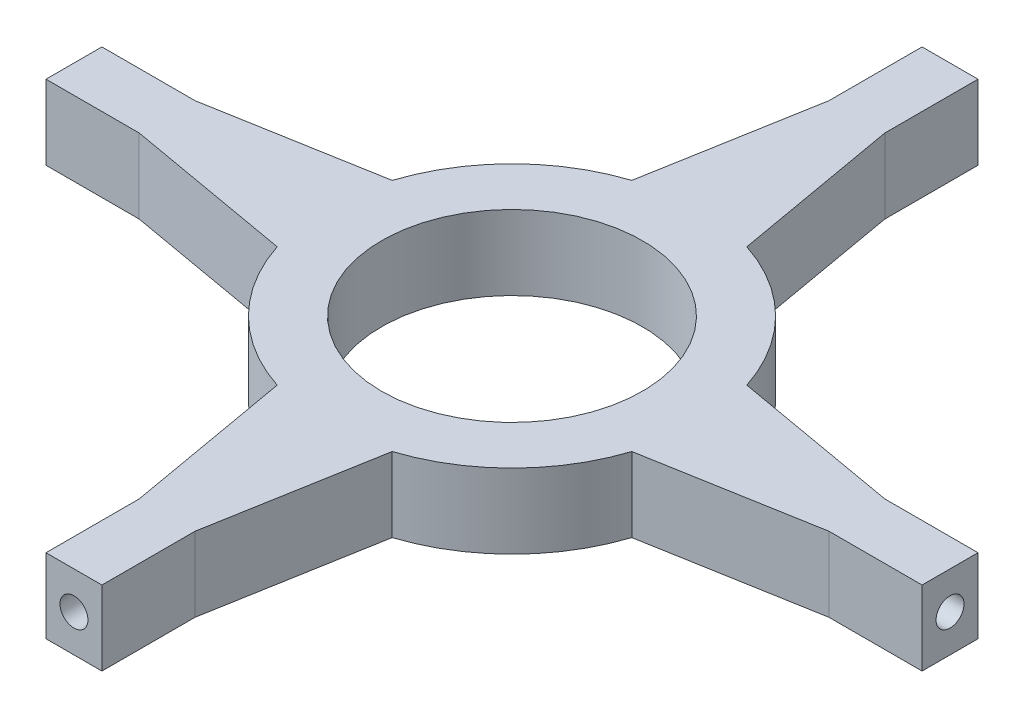
ISO-10303-21;
HEADER;
FILE_DESCRIPTION(('STEP AP214'),'2;1');
FILE_NAME('part.step','',(''),(''),'','','');
FILE_SCHEMA(('AUTOMOTIVE_DESIGN { 1 0 10303 214 1 1 1 1 }'));
ENDSEC;
DATA;
#1=APPLICATION_CONTEXT('core data for automotive mechanical design processes');
#2=APPLICATION_PROTOCOL_DEFINITION('international standard','automotive_design',2000,#1);
#3=PRODUCT_CONTEXT('',#1,'mechanical');
#4=PRODUCT('Part','Part','',(#3));
#5=PRODUCT_RELATED_PRODUCT_CATEGORY('part','',(#4));
#6=PRODUCT_DEFINITION_FORMATION('','',#4);
#7=PRODUCT_DEFINITION_CONTEXT('part definition',#1,'design');
#8=PRODUCT_DEFINITION('design','',#6,#7);
#9=PRODUCT_DEFINITION_SHAPE('','',#8);
#10=(LENGTH_UNIT() NAMED_UNIT(*) SI_UNIT(.MILLI.,.METRE.));
#11=(NAMED_UNIT(*) PLANE_ANGLE_UNIT() SI_UNIT($,.RADIAN.));
#12=(NAMED_UNIT(*) SI_UNIT($,.STERADIAN.) SOLID_ANGLE_UNIT());
#13=UNCERTAINTY_MEASURE_WITH_UNIT(LENGTH_MEASURE(1.E-05),#10,'distance_accuracy_value','');
#14=(GEOMETRIC_REPRESENTATION_CONTEXT(3) GLOBAL_UNCERTAINTY_ASSIGNED_CONTEXT((#13)) GLOBAL_UNIT_ASSIGNED_CONTEXT((#10,
#11,#12)) REPRESENTATION_CONTEXT('',''));
#15=CARTESIAN_POINT('',(0.,0.,0.));
#16=DIRECTION('',(0.,0.,1.));
#17=DIRECTION('',(1.,0.,0.));
#18=AXIS2_PLACEMENT_3D('',#15,#16,#17);
#19=CARTESIAN_POINT('',(-46.1845579135188,40.,-8.14358365224603));
#20=DIRECTION('',(-0.984807753012208,0.,-0.173648177666931));
#21=DIRECTION('',(-0.173648177666931,0.,0.984807753012208));
#22=AXIS2_PLACEMENT_3D('',#19,#20,#21);
#23=PLANE('',#22);
#24=DIRECTION('',(0.173648177666931,0.,-0.984807753012208));
#25=VECTOR('',#24,1.);
#26=CARTESIAN_POINT('',(-46.1845579135188,0.,-8.14358365224603));
#27=LINE('',#26,#25);
#28=CARTESIAN_POINT('',(-30.8477087791845,0.,-95.1231773180155));
#29=VERTEX_POINT('',#28);
#30=CARTESIAN_POINT('',(-15.,0.,-185.));
#31=VERTEX_POINT('',#30);
#32=EDGE_CURVE('E246',#29,#31,#27,.T.);
#33=ORIENTED_EDGE('',*,*,#32,.F.);
#34=DIRECTION('',(0.,-1.,0.));
#35=VECTOR('',#34,1.);
#36=CARTESIAN_POINT('',(-30.8477087791845,40.,-95.1231773180155));
#37=LINE('',#36,#35);
#38=CARTESIAN_POINT('',(-30.8477087791845,40.,-95.1231773180155));
#39=VERTEX_POINT('',#38);
#40=EDGE_CURVE('E11',#39,#29,#37,.T.);
#41=ORIENTED_EDGE('',*,*,#40,.F.);
#42=DIRECTION('',(0.173648177666931,0.,-0.984807753012208));
#43=VECTOR('',#42,1.);
#44=CARTESIAN_POINT('',(-46.1845579135188,40.,-8.14358365224603));
#45=LINE('',#44,#43);
#46=CARTESIAN_POINT('',(-15.,40.,-185.));
#47=VERTEX_POINT('',#46);
#48=EDGE_CURVE('E428',#39,#47,#45,.T.);
#49=ORIENTED_EDGE('',*,*,#48,.T.);
#50=DIRECTION('',(0.,-1.,0.));
#51=VECTOR('',#50,1.);
#52=CARTESIAN_POINT('',(-15.,40.,-185.));
#53=LINE('',#52,#51);
#54=EDGE_CURVE('E65',#47,#31,#53,.T.);
#55=ORIENTED_EDGE('',*,*,#54,.T.);
#56=EDGE_LOOP('',(#33,#41,#49,#55));
#57=FACE_BOUND('',#56,.T.);
#58=ADVANCED_FACE('F47',(#57),#23,.T.);
#59=CARTESIAN_POINT('',(0.,40.,0.));
#60=DIRECTION('',(0.,-1.,0.));
#61=DIRECTION('',(0.,0.,-1.));
#62=AXIS2_PLACEMENT_3D('',#59,#60,#61);
#63=CYLINDRICAL_SURFACE('',#62,100.);
#64=CARTESIAN_POINT('',(0.,0.,0.));
#65=DIRECTION('',(0.,1.,0.));
#66=DIRECTION('',(0.,0.,1.));
#67=AXIS2_PLACEMENT_3D('',#64,#65,#66);
#68=CIRCLE('',#67,100.);
#69=CARTESIAN_POINT('',(-95.1231773180155,0.,-30.8477087791845));
#70=VERTEX_POINT('',#69);
#71=EDGE_CURVE('E250',#29,#70,#68,.T.);
#72=ORIENTED_EDGE('',*,*,#71,.T.);
#73=DIRECTION('',(0.,-1.,0.));
#74=VECTOR('',#73,1.);
#75=CARTESIAN_POINT('',(-95.1231773180155,40.,-30.8477087791845));
#76=LINE('',#75,#74);
#77=CARTESIAN_POINT('',(-95.1231773180155,40.,-30.8477087791845));
#78=VERTEX_POINT('',#77);
#79=EDGE_CURVE('E57',#78,#70,#76,.T.);
#80=ORIENTED_EDGE('',*,*,#79,.F.);
#81=CARTESIAN_POINT('',(0.,40.,0.));
#82=DIRECTION('',(0.,1.,0.));
#83=DIRECTION('',(0.,0.,1.));
#84=AXIS2_PLACEMENT_3D('',#81,#82,#83);
#85=CIRCLE('',#84,100.);
#86=EDGE_CURVE('E421',#39,#78,#85,.T.);
#87=ORIENTED_EDGE('',*,*,#86,.F.);
#88=ORIENTED_EDGE('',*,*,#40,.T.);
#89=EDGE_LOOP('',(#72,#80,#87,#88));
#90=FACE_BOUND('',#89,.T.);
#91=ADVANCED_FACE('F409',(#90),#63,.T.);
#92=CARTESIAN_POINT('',(-8.14358365224609,40.,-46.1845579135189));
#93=DIRECTION('',(-0.173648177666932,0.,-0.984807753012208));
#94=DIRECTION('',(-0.984807753012208,0.,0.173648177666932));
#95=AXIS2_PLACEMENT_3D('',#92,#93,#94);
#96=PLANE('',#95);
#97=DIRECTION('',(0.984807753012208,0.,-0.173648177666932));
#98=VECTOR('',#97,1.);
#99=CARTESIAN_POINT('',(-8.14358365224609,0.,-46.1845579135189));
#100=LINE('',#99,#98);
#101=CARTESIAN_POINT('',(-185.,0.,-15.));
#102=VERTEX_POINT('',#101);
#103=EDGE_CURVE('E254',#102,#70,#100,.T.);
#104=ORIENTED_EDGE('',*,*,#103,.F.);
#105=DIRECTION('',(0.,-1.,0.));
#106=VECTOR('',#105,1.);
#107=CARTESIAN_POINT('',(-185.,40.,-15.));
#108=LINE('',#107,#106);
#109=CARTESIAN_POINT('',(-185.,40.,-15.));
#110=VERTEX_POINT('',#109);
#111=EDGE_CURVE('E397',#110,#102,#108,.T.);
#112=ORIENTED_EDGE('',*,*,#111,.F.);
#113=DIRECTION('',(0.984807753012208,0.,-0.173648177666932));
#114=VECTOR('',#113,1.);
#115=CARTESIAN_POINT('',(-8.14358365224609,40.,-46.1845579135189));
#116=LINE('',#115,#114);
#117=EDGE_CURVE('E406',#110,#78,#116,.T.);
#118=ORIENTED_EDGE('',*,*,#117,.T.);
#119=ORIENTED_EDGE('',*,*,#79,.T.);
#120=EDGE_LOOP('',(#104,#112,#118,#119));
#121=FACE_BOUND('',#120,.T.);
#122=ADVANCED_FACE('F404',(#121),#96,.T.);
#123=CARTESIAN_POINT('',(0.,40.,-15.));
#124=DIRECTION('',(0.,0.,-1.));
#125=DIRECTION('',(-1.,0.,0.));
#126=AXIS2_PLACEMENT_3D('',#123,#124,#125);
#127=PLANE('',#126);
#128=DIRECTION('',(1.,0.,0.));
#129=VECTOR('',#128,1.);
#130=CARTESIAN_POINT('',(0.,0.,-15.));
#131=LINE('',#130,#129);
#132=CARTESIAN_POINT('',(-235.,0.,-15.));
#133=VERTEX_POINT('',#132);
#134=EDGE_CURVE('E258',#133,#102,#131,.T.);
#135=ORIENTED_EDGE('',*,*,#134,.F.);
#136=DIRECTION('',(0.,-1.,0.));
#137=VECTOR('',#136,1.);
#138=CARTESIAN_POINT('',(-235.,40.,-15.));
#139=LINE('',#138,#137);
#140=CARTESIAN_POINT('',(-235.,40.,-15.));
#141=VERTEX_POINT('',#140);
#142=EDGE_CURVE('E394',#141,#133,#139,.T.);
#143=ORIENTED_EDGE('',*,*,#142,.F.);
#144=DIRECTION('',(1.,0.,0.));
#145=VECTOR('',#144,1.);
#146=CARTESIAN_POINT('',(0.,40.,-15.));
#147=LINE('',#146,#145);
#148=EDGE_CURVE('E418',#141,#110,#147,.T.);
#149=ORIENTED_EDGE('',*,*,#148,.T.);
#150=ORIENTED_EDGE('',*,*,#111,.T.);
#151=EDGE_LOOP('',(#135,#143,#149,#150));
#152=FACE_BOUND('',#151,.T.);
#153=ADVANCED_FACE('F415',(#152),#127,.T.);
#154=CARTESIAN_POINT('',(-235.,40.,0.));
#155=DIRECTION('',(-1.,0.,0.));
#156=DIRECTION('',(0.,0.,1.));
#157=AXIS2_PLACEMENT_3D('',#154,#155,#156);
#158=PLANE('',#157);
#159=CARTESIAN_POINT('',(-235.,20.,2.46149434388441E-12));
#160=DIRECTION('',(-1.,0.,0.));
#161=DIRECTION('',(0.,0.,1.));
#162=AXIS2_PLACEMENT_3D('',#159,#160,#161);
#163=CIRCLE('',#162,7.5);
#164=CARTESIAN_POINT('',(-235.,20.,7.50000000000246));
#165=VERTEX_POINT('',#164);
#166=EDGE_CURVE('E603',#165,#165,#163,.T.);
#167=ORIENTED_EDGE('',*,*,#166,.F.);
#168=EDGE_LOOP('',(#167));
#169=FACE_BOUND('',#168,.T.);
#170=DIRECTION('',(0.,0.,-1.));
#171=VECTOR('',#170,1.);
#172=CARTESIAN_POINT('',(-235.,0.,0.));
#173=LINE('',#172,#171);
#174=CARTESIAN_POINT('',(-235.,0.,15.));
#175=VERTEX_POINT('',#174);
#176=EDGE_CURVE('E262',#175,#133,#173,.T.);
#177=ORIENTED_EDGE('',*,*,#176,.F.);
#178=DIRECTION('',(0.,-1.,0.));
#179=VECTOR('',#178,1.);
#180=CARTESIAN_POINT('',(-235.,40.,15.));
#181=LINE('',#180,#179);
#182=CARTESIAN_POINT('',(-235.,40.,15.));
#183=VERTEX_POINT('',#182);
#184=EDGE_CURVE('E391',#183,#175,#181,.T.);
#185=ORIENTED_EDGE('',*,*,#184,.F.);
#186=DIRECTION('',(0.,0.,-1.));
#187=VECTOR('',#186,1.);
#188=CARTESIAN_POINT('',(-235.,40.,0.));
#189=LINE('',#188,#187);
#190=EDGE_CURVE('E426',#183,#141,#189,.T.);
#191=ORIENTED_EDGE('',*,*,#190,.T.);
#192=ORIENTED_EDGE('',*,*,#142,.T.);
#193=EDGE_LOOP('',(#177,#185,#191,#192));
#194=FACE_BOUND('',#193,.T.);
#195=ADVANCED_FACE('F518',(#169,#194),#158,.T.);
#196=CARTESIAN_POINT('',(0.,40.,15.));
#197=DIRECTION('',(0.,0.,1.));
#198=DIRECTION('',(1.,0.,0.));
#199=AXIS2_PLACEMENT_3D('',#196,#197,#198);
#200=PLANE('',#199);
#201=DIRECTION('',(-1.,0.,0.));
#202=VECTOR('',#201,1.);
#203=CARTESIAN_POINT('',(0.,0.,15.));
#204=LINE('',#203,#202);
#205=CARTESIAN_POINT('',(-185.,0.,15.));
#206=VERTEX_POINT('',#205);
#207=EDGE_CURVE('E266',#206,#175,#204,.T.);
#208=ORIENTED_EDGE('',*,*,#207,.F.);
#209=DIRECTION('',(0.,-1.,0.));
#210=VECTOR('',#209,1.);
#211=CARTESIAN_POINT('',(-185.,40.,15.));
#212=LINE('',#211,#210);
#213=CARTESIAN_POINT('',(-185.,40.,15.));
#214=VERTEX_POINT('',#213);
#215=EDGE_CURVE('E388',#214,#206,#212,.T.);
#216=ORIENTED_EDGE('',*,*,#215,.F.);
#217=DIRECTION('',(-1.,0.,0.));
#218=VECTOR('',#217,1.);
#219=CARTESIAN_POINT('',(0.,40.,15.));
#220=LINE('',#219,#218);
#221=EDGE_CURVE('E434',#214,#183,#220,.T.);
#222=ORIENTED_EDGE('',*,*,#221,.T.);
#223=ORIENTED_EDGE('',*,*,#184,.T.);
#224=EDGE_LOOP('',(#208,#216,#222,#223));
#225=FACE_BOUND('',#224,.T.);
#226=ADVANCED_FACE('F521',(#225),#200,.T.);
#227=CARTESIAN_POINT('',(-8.14358365224603,40.,46.1845579135188));
#228=DIRECTION('',(-0.173648177666931,0.,0.984807753012208));
#229=DIRECTION('',(0.984807753012208,0.,0.173648177666931));
#230=AXIS2_PLACEMENT_3D('',#227,#228,#229);
#231=PLANE('',#230);
#232=DIRECTION('',(-0.984807753012208,0.,-0.173648177666931));
#233=VECTOR('',#232,1.);
#234=CARTESIAN_POINT('',(-8.14358365224603,0.,46.1845579135188));
#235=LINE('',#234,#233);
#236=CARTESIAN_POINT('',(-95.1231773180155,0.,30.8477087791845));
#237=VERTEX_POINT('',#236);
#238=EDGE_CURVE('E270',#237,#206,#235,.T.);
#239=ORIENTED_EDGE('',*,*,#238,.F.);
#240=DIRECTION('',(0.,-1.,0.));
#241=VECTOR('',#240,1.);
#242=CARTESIAN_POINT('',(-95.1231773180155,40.,30.8477087791845));
#243=LINE('',#242,#241);
#244=CARTESIAN_POINT('',(-95.1231773180155,40.,30.8477087791845));
#245=VERTEX_POINT('',#244);
#246=EDGE_CURVE('E385',#245,#237,#243,.T.);
#247=ORIENTED_EDGE('',*,*,#246,.F.);
#248=DIRECTION('',(-0.984807753012208,0.,-0.173648177666931));
#249=VECTOR('',#248,1.);
#250=CARTESIAN_POINT('',(-8.14358365224603,40.,46.1845579135188));
#251=LINE('',#250,#249);
#252=EDGE_CURVE('E438',#245,#214,#251,.T.);
#253=ORIENTED_EDGE('',*,*,#252,.T.);
#254=ORIENTED_EDGE('',*,*,#215,.T.);
#255=EDGE_LOOP('',(#239,#247,#253,#254));
#256=FACE_BOUND('',#255,.T.);
#257=ADVANCED_FACE('F525',(#256),#231,.T.);
#258=CARTESIAN_POINT('',(0.,40.,0.));
#259=DIRECTION('',(0.,-1.,0.));
#260=DIRECTION('',(0.,0.,-1.));
#261=AXIS2_PLACEMENT_3D('',#258,#259,#260);
#262=CYLINDRICAL_SURFACE('',#261,100.);
#263=CARTESIAN_POINT('',(0.,0.,0.));
#264=DIRECTION('',(0.,1.,0.));
#265=DIRECTION('',(0.,0.,1.));
#266=AXIS2_PLACEMENT_3D('',#263,#264,#265);
#267=CIRCLE('',#266,100.);
#268=CARTESIAN_POINT('',(-30.8477087791845,0.,95.1231773180155));
#269=VERTEX_POINT('',#268);
#270=EDGE_CURVE('E274',#237,#269,#267,.T.);
#271=ORIENTED_EDGE('',*,*,#270,.T.);
#272=DIRECTION('',(0.,-1.,0.));
#273=VECTOR('',#272,1.);
#274=CARTESIAN_POINT('',(-30.8477087791845,40.,95.1231773180155));
#275=LINE('',#274,#273);
#276=CARTESIAN_POINT('',(-30.8477087791845,40.,95.1231773180155));
#277=VERTEX_POINT('',#276);
#278=EDGE_CURVE('E382',#277,#269,#275,.T.);
#279=ORIENTED_EDGE('',*,*,#278,.F.);
#280=CARTESIAN_POINT('',(0.,40.,0.));
#281=DIRECTION('',(0.,1.,0.));
#282=DIRECTION('',(0.,0.,1.));
#283=AXIS2_PLACEMENT_3D('',#280,#281,#282);
#284=CIRCLE('',#283,100.);
#285=EDGE_CURVE('E442',#245,#277,#284,.T.);
#286=ORIENTED_EDGE('',*,*,#285,.F.);
#287=ORIENTED_EDGE('',*,*,#246,.T.);
#288=EDGE_LOOP('',(#271,#279,#286,#287));
#289=FACE_BOUND('',#288,.T.);
#290=ADVANCED_FACE('F529',(#289),#262,.T.);
#291=CARTESIAN_POINT('',(-46.1845579135189,40.,8.14358365224608));
#292=DIRECTION('',(-0.984807753012208,0.,0.173648177666931));
#293=DIRECTION('',(0.173648177666931,0.,0.984807753012208));
#294=AXIS2_PLACEMENT_3D('',#291,#292,#293);
#295=PLANE('',#294);
#296=DIRECTION('',(-0.173648177666931,0.,-0.984807753012208));
#297=VECTOR('',#296,1.);
#298=CARTESIAN_POINT('',(-46.1845579135189,0.,8.14358365224608));
#299=LINE('',#298,#297);
#300=CARTESIAN_POINT('',(-15.,0.,185.));
#301=VERTEX_POINT('',#300);
#302=EDGE_CURVE('E278',#301,#269,#299,.T.);
#303=ORIENTED_EDGE('',*,*,#302,.F.);
#304=DIRECTION('',(0.,-1.,0.));
#305=VECTOR('',#304,1.);
#306=CARTESIAN_POINT('',(-15.,40.,185.));
#307=LINE('',#306,#305);
#308=CARTESIAN_POINT('',(-15.,40.,185.));
#309=VERTEX_POINT('',#308);
#310=EDGE_CURVE('E379',#309,#301,#307,.T.);
#311=ORIENTED_EDGE('',*,*,#310,.F.);
#312=DIRECTION('',(-0.173648177666931,0.,-0.984807753012208));
#313=VECTOR('',#312,1.);
#314=CARTESIAN_POINT('',(-46.1845579135189,40.,8.14358365224608));
#315=LINE('',#314,#313);
#316=EDGE_CURVE('E445',#309,#277,#315,.T.);
#317=ORIENTED_EDGE('',*,*,#316,.T.);
#318=ORIENTED_EDGE('',*,*,#278,.T.);
#319=EDGE_LOOP('',(#303,#311,#317,#318));
#320=FACE_BOUND('',#319,.T.);
#321=ADVANCED_FACE('F533',(#320),#295,.T.);
#322=CARTESIAN_POINT('',(-15.,40.,0.));
#323=DIRECTION('',(-1.,0.,0.));
#324=DIRECTION('',(0.,0.,1.));
#325=AXIS2_PLACEMENT_3D('',#322,#323,#324);
#326=PLANE('',#325);
#327=DIRECTION('',(0.,0.,-1.));
#328=VECTOR('',#327,1.);
#329=CARTESIAN_POINT('',(-15.,0.,0.));
#330=LINE('',#329,#328);
#331=CARTESIAN_POINT('',(-15.,0.,235.));
#332=VERTEX_POINT('',#331);
#333=EDGE_CURVE('E282',#332,#301,#330,.T.);
#334=ORIENTED_EDGE('',*,*,#333,.F.);
#335=DIRECTION('',(0.,-1.,0.));
#336=VECTOR('',#335,1.);
#337=CARTESIAN_POINT('',(-15.,40.,235.));
#338=LINE('',#337,#336);
#339=CARTESIAN_POINT('',(-15.,40.,235.));
#340=VERTEX_POINT('',#339);
#341=EDGE_CURVE('E376',#340,#332,#338,.T.);
#342=ORIENTED_EDGE('',*,*,#341,.F.);
#343=DIRECTION('',(0.,0.,-1.));
#344=VECTOR('',#343,1.);
#345=CARTESIAN_POINT('',(-15.,40.,0.));
#346=LINE('',#345,#344);
#347=EDGE_CURVE('E449',#340,#309,#346,.T.);
#348=ORIENTED_EDGE('',*,*,#347,.T.);
#349=ORIENTED_EDGE('',*,*,#310,.T.);
#350=EDGE_LOOP('',(#334,#342,#348,#349));
#351=FACE_BOUND('',#350,.T.);
#352=ADVANCED_FACE('F537',(#351),#326,.T.);
#353=CARTESIAN_POINT('',(0.,40.,235.));
#354=DIRECTION('',(0.,0.,1.));
#355=DIRECTION('',(1.,0.,0.));
#356=AXIS2_PLACEMENT_3D('',#353,#354,#355);
#357=PLANE('',#356);
#358=CARTESIAN_POINT('',(0.,20.,235.));
#359=DIRECTION('',(0.,0.,1.));
#360=DIRECTION('',(1.,0.,0.));
#361=AXIS2_PLACEMENT_3D('',#358,#359,#360);
#362=CIRCLE('',#361,7.5);
#363=CARTESIAN_POINT('',(7.5,20.,235.));
#364=VERTEX_POINT('',#363);
#365=EDGE_CURVE('E613',#364,#364,#362,.T.);
#366=ORIENTED_EDGE('',*,*,#365,.F.);
#367=EDGE_LOOP('',(#366));
#368=FACE_BOUND('',#367,.T.);
#369=DIRECTION('',(-1.,0.,0.));
#370=VECTOR('',#369,1.);
#371=CARTESIAN_POINT('',(0.,0.,235.));
#372=LINE('',#371,#370);
#373=CARTESIAN_POINT('',(15.,0.,235.));
#374=VERTEX_POINT('',#373);
#375=EDGE_CURVE('E286',#374,#332,#372,.T.);
#376=ORIENTED_EDGE('',*,*,#375,.F.);
#377=DIRECTION('',(0.,-1.,0.));
#378=VECTOR('',#377,1.);
#379=CARTESIAN_POINT('',(15.,40.,235.));
#380=LINE('',#379,#378);
#381=CARTESIAN_POINT('',(15.,40.,235.));
#382=VERTEX_POINT('',#381);
#383=EDGE_CURVE('E373',#382,#374,#380,.T.);
#384=ORIENTED_EDGE('',*,*,#383,.F.);
#385=DIRECTION('',(-1.,0.,0.));
#386=VECTOR('',#385,1.);
#387=CARTESIAN_POINT('',(0.,40.,235.));
#388=LINE('',#387,#386);
#389=EDGE_CURVE('E453',#382,#340,#388,.T.);
#390=ORIENTED_EDGE('',*,*,#389,.T.);
#391=ORIENTED_EDGE('',*,*,#341,.T.);
#392=EDGE_LOOP('',(#376,#384,#390,#391));
#393=FACE_BOUND('',#392,.T.);
#394=ADVANCED_FACE('F541',(#368,#393),#357,.T.);
#395=CARTESIAN_POINT('',(15.,40.,0.));
#396=DIRECTION('',(1.,0.,0.));
#397=DIRECTION('',(0.,0.,-1.));
#398=AXIS2_PLACEMENT_3D('',#395,#396,#397);
#399=PLANE('',#398);
#400=DIRECTION('',(0.,0.,1.));
#401=VECTOR('',#400,1.);
#402=CARTESIAN_POINT('',(15.,0.,0.));
#403=LINE('',#402,#401);
#404=CARTESIAN_POINT('',(15.,0.,185.));
#405=VERTEX_POINT('',#404);
#406=EDGE_CURVE('E290',#405,#374,#403,.T.);
#407=ORIENTED_EDGE('',*,*,#406,.F.);
#408=DIRECTION('',(0.,-1.,0.));
#409=VECTOR('',#408,1.);
#410=CARTESIAN_POINT('',(15.,40.,185.));
#411=LINE('',#410,#409);
#412=CARTESIAN_POINT('',(15.,40.,185.));
#413=VERTEX_POINT('',#412);
#414=EDGE_CURVE('E370',#413,#405,#411,.T.);
#415=ORIENTED_EDGE('',*,*,#414,.F.);
#416=DIRECTION('',(0.,0.,1.));
#417=VECTOR('',#416,1.);
#418=CARTESIAN_POINT('',(15.,40.,0.));
#419=LINE('',#418,#417);
#420=EDGE_CURVE('E457',#413,#382,#419,.T.);
#421=ORIENTED_EDGE('',*,*,#420,.T.);
#422=ORIENTED_EDGE('',*,*,#383,.T.);
#423=EDGE_LOOP('',(#407,#415,#421,#422));
#424=FACE_BOUND('',#423,.T.);
#425=ADVANCED_FACE('F545',(#424),#399,.T.);
#426=CARTESIAN_POINT('',(46.1845579135188,40.,8.14358365224603));
#427=DIRECTION('',(0.984807753012208,0.,0.173648177666931));
#428=DIRECTION('',(0.173648177666931,0.,-0.984807753012208));
#429=AXIS2_PLACEMENT_3D('',#426,#427,#428);
#430=PLANE('',#429);
#431=DIRECTION('',(-0.173648177666931,0.,0.984807753012208));
#432=VECTOR('',#431,1.);
#433=CARTESIAN_POINT('',(46.1845579135188,0.,8.14358365224603));
#434=LINE('',#433,#432);
#435=CARTESIAN_POINT('',(30.8477087791845,0.,95.1231773180156));
#436=VERTEX_POINT('',#435);
#437=EDGE_CURVE('E294',#436,#405,#434,.T.);
#438=ORIENTED_EDGE('',*,*,#437,.F.);
#439=DIRECTION('',(0.,-1.,0.));
#440=VECTOR('',#439,1.);
#441=CARTESIAN_POINT('',(30.8477087791845,40.,95.1231773180156));
#442=LINE('',#441,#440);
#443=CARTESIAN_POINT('',(30.8477087791845,40.,95.1231773180156));
#444=VERTEX_POINT('',#443);
#445=EDGE_CURVE('E367',#444,#436,#442,.T.);
#446=ORIENTED_EDGE('',*,*,#445,.F.);
#447=DIRECTION('',(-0.173648177666931,0.,0.984807753012208));
#448=VECTOR('',#447,1.);
#449=CARTESIAN_POINT('',(46.1845579135188,40.,8.14358365224603));
#450=LINE('',#449,#448);
#451=EDGE_CURVE('E461',#444,#413,#450,.T.);
#452=ORIENTED_EDGE('',*,*,#451,.T.);
#453=ORIENTED_EDGE('',*,*,#414,.T.);
#454=EDGE_LOOP('',(#438,#446,#452,#453));
#455=FACE_BOUND('',#454,.T.);
#456=ADVANCED_FACE('F549',(#455),#430,.T.);
#457=CARTESIAN_POINT('',(0.,40.,0.));
#458=DIRECTION('',(0.,-1.,0.));
#459=DIRECTION('',(0.,0.,-1.));
#460=AXIS2_PLACEMENT_3D('',#457,#458,#459);
#461=CYLINDRICAL_SURFACE('',#460,100.);
#462=CARTESIAN_POINT('',(0.,0.,0.));
#463=DIRECTION('',(0.,1.,0.));
#464=DIRECTION('',(0.,0.,1.));
#465=AXIS2_PLACEMENT_3D('',#462,#463,#464);
#466=CIRCLE('',#465,100.);
#467=CARTESIAN_POINT('',(95.1231773180155,0.,30.8477087791845));
#468=VERTEX_POINT('',#467);
#469=EDGE_CURVE('E298',#436,#468,#466,.T.);
#470=ORIENTED_EDGE('',*,*,#469,.T.);
#471=DIRECTION('',(0.,-1.,0.));
#472=VECTOR('',#471,1.);
#473=CARTESIAN_POINT('',(95.1231773180155,40.,30.8477087791845));
#474=LINE('',#473,#472);
#475=CARTESIAN_POINT('',(95.1231773180155,40.,30.8477087791845));
#476=VERTEX_POINT('',#475);
#477=EDGE_CURVE('E364',#476,#468,#474,.T.);
#478=ORIENTED_EDGE('',*,*,#477,.F.);
#479=CARTESIAN_POINT('',(0.,40.,0.));
#480=DIRECTION('',(0.,1.,0.));
#481=DIRECTION('',(0.,0.,1.));
#482=AXIS2_PLACEMENT_3D('',#479,#480,#481);
#483=CIRCLE('',#482,100.);
#484=EDGE_CURVE('E465',#444,#476,#483,.T.);
#485=ORIENTED_EDGE('',*,*,#484,.F.);
#486=ORIENTED_EDGE('',*,*,#445,.T.);
#487=EDGE_LOOP('',(#470,#478,#485,#486));
#488=FACE_BOUND('',#487,.T.);
#489=ADVANCED_FACE('F553',(#488),#461,.T.);
#490=CARTESIAN_POINT('',(8.14358365224607,40.,46.1845579135189));
#491=DIRECTION('',(0.173648177666931,0.,0.984807753012208));
#492=DIRECTION('',(0.984807753012208,0.,-0.173648177666931));
#493=AXIS2_PLACEMENT_3D('',#490,#491,#492);
#494=PLANE('',#493);
#495=DIRECTION('',(-0.984807753012208,0.,0.173648177666931));
#496=VECTOR('',#495,1.);
#497=CARTESIAN_POINT('',(8.14358365224607,0.,46.1845579135189));
#498=LINE('',#497,#496);
#499=CARTESIAN_POINT('',(185.,0.,15.));
#500=VERTEX_POINT('',#499);
#501=EDGE_CURVE('E302',#500,#468,#498,.T.);
#502=ORIENTED_EDGE('',*,*,#501,.F.);
#503=DIRECTION('',(0.,-1.,0.));
#504=VECTOR('',#503,1.);
#505=CARTESIAN_POINT('',(185.,40.,15.));
#506=LINE('',#505,#504);
#507=CARTESIAN_POINT('',(185.,40.,15.));
#508=VERTEX_POINT('',#507);
#509=EDGE_CURVE('E361',#508,#500,#506,.T.);
#510=ORIENTED_EDGE('',*,*,#509,.F.);
#511=DIRECTION('',(-0.984807753012208,0.,0.173648177666931));
#512=VECTOR('',#511,1.);
#513=CARTESIAN_POINT('',(8.14358365224607,40.,46.1845579135189));
#514=LINE('',#513,#512);
#515=EDGE_CURVE('E468',#508,#476,#514,.T.);
#516=ORIENTED_EDGE('',*,*,#515,.T.);
#517=ORIENTED_EDGE('',*,*,#477,.T.);
#518=EDGE_LOOP('',(#502,#510,#516,#517));
#519=FACE_BOUND('',#518,.T.);
#520=ADVANCED_FACE('F557',(#519),#494,.T.);
#521=CARTESIAN_POINT('',(0.,40.,15.));
#522=DIRECTION('',(0.,0.,1.));
#523=DIRECTION('',(1.,0.,0.));
#524=AXIS2_PLACEMENT_3D('',#521,#522,#523);
#525=PLANE('',#524);
#526=DIRECTION('',(-1.,0.,0.));
#527=VECTOR('',#526,1.);
#528=CARTESIAN_POINT('',(0.,0.,15.));
#529=LINE('',#528,#527);
#530=CARTESIAN_POINT('',(235.,0.,15.));
#531=VERTEX_POINT('',#530);
#532=EDGE_CURVE('E306',#531,#500,#529,.T.);
#533=ORIENTED_EDGE('',*,*,#532,.F.);
#534=DIRECTION('',(0.,-1.,0.));
#535=VECTOR('',#534,1.);
#536=CARTESIAN_POINT('',(235.,40.,15.));
#537=LINE('',#536,#535);
#538=CARTESIAN_POINT('',(235.,40.,15.));
#539=VERTEX_POINT('',#538);
#540=EDGE_CURVE('E358',#539,#531,#537,.T.);
#541=ORIENTED_EDGE('',*,*,#540,.F.);
#542=DIRECTION('',(-1.,0.,0.));
#543=VECTOR('',#542,1.);
#544=CARTESIAN_POINT('',(0.,40.,15.));
#545=LINE('',#544,#543);
#546=EDGE_CURVE('E472',#539,#508,#545,.T.);
#547=ORIENTED_EDGE('',*,*,#546,.T.);
#548=ORIENTED_EDGE('',*,*,#509,.T.);
#549=EDGE_LOOP('',(#533,#541,#547,#548));
#550=FACE_BOUND('',#549,.T.);
#551=ADVANCED_FACE('F561',(#550),#525,.T.);
#552=CARTESIAN_POINT('',(235.,40.,0.));
#553=DIRECTION('',(1.,0.,0.));
#554=DIRECTION('',(0.,0.,-1.));
#555=AXIS2_PLACEMENT_3D('',#552,#553,#554);
#556=PLANE('',#555);
#557=CARTESIAN_POINT('',(235.,20.,-8.20498114628136E-13));
#558=DIRECTION('',(1.,0.,0.));
#559=DIRECTION('',(0.,0.,-1.));
#560=AXIS2_PLACEMENT_3D('',#557,#558,#559);
#561=CIRCLE('',#560,7.5);
#562=CARTESIAN_POINT('',(235.,20.,-7.50000000000082));
#563=VERTEX_POINT('',#562);
#564=EDGE_CURVE('E600',#563,#563,#561,.T.);
#565=ORIENTED_EDGE('',*,*,#564,.F.);
#566=EDGE_LOOP('',(#565));
#567=FACE_BOUND('',#566,.T.);
#568=DIRECTION('',(0.,0.,1.));
#569=VECTOR('',#568,1.);
#570=CARTESIAN_POINT('',(235.,0.,0.));
#571=LINE('',#570,#569);
#572=CARTESIAN_POINT('',(235.,0.,-15.));
#573=VERTEX_POINT('',#572);
#574=EDGE_CURVE('E310',#573,#531,#571,.T.);
#575=ORIENTED_EDGE('',*,*,#574,.F.);
#576=DIRECTION('',(0.,-1.,0.));
#577=VECTOR('',#576,1.);
#578=CARTESIAN_POINT('',(235.,40.,-15.));
#579=LINE('',#578,#577);
#580=CARTESIAN_POINT('',(235.,40.,-15.));
#581=VERTEX_POINT('',#580);
#582=EDGE_CURVE('E355',#581,#573,#579,.T.);
#583=ORIENTED_EDGE('',*,*,#582,.F.);
#584=DIRECTION('',(0.,0.,1.));
#585=VECTOR('',#584,1.);
#586=CARTESIAN_POINT('',(235.,40.,0.));
#587=LINE('',#586,#585);
#588=EDGE_CURVE('E476',#581,#539,#587,.T.);
#589=ORIENTED_EDGE('',*,*,#588,.T.);
#590=ORIENTED_EDGE('',*,*,#540,.T.);
#591=EDGE_LOOP('',(#575,#583,#589,#590));
#592=FACE_BOUND('',#591,.T.);
#593=ADVANCED_FACE('F565',(#567,#592),#556,.T.);
#594=CARTESIAN_POINT('',(0.,40.,-15.));
#595=DIRECTION('',(0.,0.,-1.));
#596=DIRECTION('',(-1.,0.,0.));
#597=AXIS2_PLACEMENT_3D('',#594,#595,#596);
#598=PLANE('',#597);
#599=DIRECTION('',(1.,0.,0.));
#600=VECTOR('',#599,1.);
#601=CARTESIAN_POINT('',(0.,0.,-15.));
#602=LINE('',#601,#600);
#603=CARTESIAN_POINT('',(185.,0.,-15.));
#604=VERTEX_POINT('',#603);
#605=EDGE_CURVE('E314',#604,#573,#602,.T.);
#606=ORIENTED_EDGE('',*,*,#605,.F.);
#607=DIRECTION('',(0.,-1.,0.));
#608=VECTOR('',#607,1.);
#609=CARTESIAN_POINT('',(185.,40.,-15.));
#610=LINE('',#609,#608);
#611=CARTESIAN_POINT('',(185.,40.,-15.));
#612=VERTEX_POINT('',#611);
#613=EDGE_CURVE('E352',#612,#604,#610,.T.);
#614=ORIENTED_EDGE('',*,*,#613,.F.);
#615=DIRECTION('',(1.,0.,0.));
#616=VECTOR('',#615,1.);
#617=CARTESIAN_POINT('',(0.,40.,-15.));
#618=LINE('',#617,#616);
#619=EDGE_CURVE('E480',#612,#581,#618,.T.);
#620=ORIENTED_EDGE('',*,*,#619,.T.);
#621=ORIENTED_EDGE('',*,*,#582,.T.);
#622=EDGE_LOOP('',(#606,#614,#620,#621));
#623=FACE_BOUND('',#622,.T.);
#624=ADVANCED_FACE('F569',(#623),#598,.T.);
#625=CARTESIAN_POINT('',(8.14358365224603,40.,-46.1845579135188));
#626=DIRECTION('',(0.173648177666931,0.,-0.984807753012208));
#627=DIRECTION('',(-0.984807753012208,0.,-0.173648177666931));
#628=AXIS2_PLACEMENT_3D('',#625,#626,#627);
#629=PLANE('',#628);
#630=DIRECTION('',(0.984807753012208,0.,0.173648177666931));
#631=VECTOR('',#630,1.);
#632=CARTESIAN_POINT('',(8.14358365224603,0.,-46.1845579135188));
#633=LINE('',#632,#631);
#634=CARTESIAN_POINT('',(95.1231773180156,0.,-30.8477087791845));
#635=VERTEX_POINT('',#634);
#636=EDGE_CURVE('E318',#635,#604,#633,.T.);
#637=ORIENTED_EDGE('',*,*,#636,.F.);
#638=DIRECTION('',(0.,-1.,0.));
#639=VECTOR('',#638,1.);
#640=CARTESIAN_POINT('',(95.1231773180156,40.,-30.8477087791845));
#641=LINE('',#640,#639);
#642=CARTESIAN_POINT('',(95.1231773180156,40.,-30.8477087791845));
#643=VERTEX_POINT('',#642);
#644=EDGE_CURVE('E349',#643,#635,#641,.T.);
#645=ORIENTED_EDGE('',*,*,#644,.F.);
#646=DIRECTION('',(0.984807753012208,0.,0.173648177666931));
#647=VECTOR('',#646,1.);
#648=CARTESIAN_POINT('',(8.14358365224603,40.,-46.1845579135188));
#649=LINE('',#648,#647);
#650=EDGE_CURVE('E484',#643,#612,#649,.T.);
#651=ORIENTED_EDGE('',*,*,#650,.T.);
#652=ORIENTED_EDGE('',*,*,#613,.T.);
#653=EDGE_LOOP('',(#637,#645,#651,#652));
#654=FACE_BOUND('',#653,.T.);
#655=ADVANCED_FACE('F573',(#654),#629,.T.);
#656=CARTESIAN_POINT('',(0.,40.,0.));
#657=DIRECTION('',(0.,-1.,0.));
#658=DIRECTION('',(0.,0.,-1.));
#659=AXIS2_PLACEMENT_3D('',#656,#657,#658);
#660=CYLINDRICAL_SURFACE('',#659,100.);
#661=CARTESIAN_POINT('',(0.,0.,0.));
#662=DIRECTION('',(0.,1.,0.));
#663=DIRECTION('',(0.,0.,1.));
#664=AXIS2_PLACEMENT_3D('',#661,#662,#663);
#665=CIRCLE('',#664,100.);
#666=CARTESIAN_POINT('',(30.8477087791845,0.,-95.1231773180155));
#667=VERTEX_POINT('',#666);
#668=EDGE_CURVE('E322',#635,#667,#665,.T.);
#669=ORIENTED_EDGE('',*,*,#668,.T.);
#670=DIRECTION('',(0.,-1.,0.));
#671=VECTOR('',#670,1.);
#672=CARTESIAN_POINT('',(30.8477087791845,40.,-95.1231773180155));
#673=LINE('',#672,#671);
#674=CARTESIAN_POINT('',(30.8477087791845,40.,-95.1231773180155));
#675=VERTEX_POINT('',#674);
#676=EDGE_CURVE('E346',#675,#667,#673,.T.);
#677=ORIENTED_EDGE('',*,*,#676,.F.);
#678=CARTESIAN_POINT('',(0.,40.,0.));
#679=DIRECTION('',(0.,1.,0.));
#680=DIRECTION('',(0.,0.,1.));
#681=AXIS2_PLACEMENT_3D('',#678,#679,#680);
#682=CIRCLE('',#681,100.);
#683=EDGE_CURVE('E488',#643,#675,#682,.T.);
#684=ORIENTED_EDGE('',*,*,#683,.F.);
#685=ORIENTED_EDGE('',*,*,#644,.T.);
#686=EDGE_LOOP('',(#669,#677,#684,#685));
#687=FACE_BOUND('',#686,.T.);
#688=ADVANCED_FACE('F577',(#687),#660,.T.);
#689=CARTESIAN_POINT('',(46.1845579135189,40.,-8.14358365224609));
#690=DIRECTION('',(0.984807753012208,0.,-0.173648177666932));
#691=DIRECTION('',(-0.173648177666932,0.,-0.984807753012208));
#692=AXIS2_PLACEMENT_3D('',#689,#690,#691);
#693=PLANE('',#692);
#694=DIRECTION('',(0.173648177666932,0.,0.984807753012208));
#695=VECTOR('',#694,1.);
#696=CARTESIAN_POINT('',(46.1845579135189,0.,-8.14358365224609));
#697=LINE('',#696,#695);
#698=CARTESIAN_POINT('',(15.,0.,-185.));
#699=VERTEX_POINT('',#698);
#700=EDGE_CURVE('E326',#699,#667,#697,.T.);
#701=ORIENTED_EDGE('',*,*,#700,.F.);
#702=DIRECTION('',(0.,-1.,0.));
#703=VECTOR('',#702,1.);
#704=CARTESIAN_POINT('',(15.,40.,-185.));
#705=LINE('',#704,#703);
#706=CARTESIAN_POINT('',(15.,40.,-185.));
#707=VERTEX_POINT('',#706);
#708=EDGE_CURVE('E221',#707,#699,#705,.T.);
#709=ORIENTED_EDGE('',*,*,#708,.F.);
#710=DIRECTION('',(0.173648177666932,0.,0.984807753012208));
#711=VECTOR('',#710,1.);
#712=CARTESIAN_POINT('',(46.1845579135189,40.,-8.14358365224609));
#713=LINE('',#712,#711);
#714=EDGE_CURVE('E231',#707,#675,#713,.T.);
#715=ORIENTED_EDGE('',*,*,#714,.T.);
#716=ORIENTED_EDGE('',*,*,#676,.T.);
#717=EDGE_LOOP('',(#701,#709,#715,#716));
#718=FACE_BOUND('',#717,.T.);
#719=ADVANCED_FACE('F493',(#718),#693,.T.);
#720=CARTESIAN_POINT('',(15.,40.,0.));
#721=DIRECTION('',(1.,0.,0.));
#722=DIRECTION('',(0.,0.,-1.));
#723=AXIS2_PLACEMENT_3D('',#720,#721,#722);
#724=PLANE('',#723);
#725=DIRECTION('',(0.,0.,1.));
#726=VECTOR('',#725,1.);
#727=CARTESIAN_POINT('',(15.,0.,0.));
#728=LINE('',#727,#726);
#729=CARTESIAN_POINT('',(15.,0.,-235.));
#730=VERTEX_POINT('',#729);
#731=EDGE_CURVE('E216',#730,#699,#728,.T.);
#732=ORIENTED_EDGE('',*,*,#731,.F.);
#733=DIRECTION('',(0.,-1.,0.));
#734=VECTOR('',#733,1.);
#735=CARTESIAN_POINT('',(15.,40.,-235.));
#736=LINE('',#735,#734);
#737=CARTESIAN_POINT('',(15.,40.,-235.));
#738=VERTEX_POINT('',#737);
#739=EDGE_CURVE('E211',#738,#730,#736,.T.);
#740=ORIENTED_EDGE('',*,*,#739,.F.);
#741=DIRECTION('',(0.,0.,1.));
#742=VECTOR('',#741,1.);
#743=CARTESIAN_POINT('',(15.,40.,0.));
#744=LINE('',#743,#742);
#745=EDGE_CURVE('E214',#738,#707,#744,.T.);
#746=ORIENTED_EDGE('',*,*,#745,.T.);
#747=ORIENTED_EDGE('',*,*,#708,.T.);
#748=EDGE_LOOP('',(#732,#740,#746,#747));
#749=FACE_BOUND('',#748,.T.);
#750=ADVANCED_FACE('F213',(#749),#724,.T.);
#751=CARTESIAN_POINT('',(0.,40.,-235.));
#752=DIRECTION('',(0.,0.,-1.));
#753=DIRECTION('',(-1.,0.,0.));
#754=AXIS2_PLACEMENT_3D('',#751,#752,#753);
#755=PLANE('',#754);
#756=CARTESIAN_POINT('',(0.,20.,-235.));
#757=DIRECTION('',(0.,0.,-1.));
#758=DIRECTION('',(-1.,0.,0.));
#759=AXIS2_PLACEMENT_3D('',#756,#757,#758);
#760=CIRCLE('',#759,7.5);
#761=CARTESIAN_POINT('',(-7.5,20.,-235.));
#762=VERTEX_POINT('',#761);
#763=EDGE_CURVE('E591',#762,#762,#760,.T.);
#764=ORIENTED_EDGE('',*,*,#763,.F.);
#765=EDGE_LOOP('',(#764));
#766=FACE_BOUND('',#765,.T.);
#767=DIRECTION('',(1.,0.,0.));
#768=VECTOR('',#767,1.);
#769=CARTESIAN_POINT('',(0.,0.,-235.));
#770=LINE('',#769,#768);
#771=CARTESIAN_POINT('',(-15.,0.,-235.));
#772=VERTEX_POINT('',#771);
#773=EDGE_CURVE('E332',#772,#730,#770,.T.);
#774=ORIENTED_EDGE('',*,*,#773,.F.);
#775=DIRECTION('',(0.,-1.,0.));
#776=VECTOR('',#775,1.);
#777=CARTESIAN_POINT('',(-15.,40.,-235.));
#778=LINE('',#777,#776);
#779=CARTESIAN_POINT('',(-15.,40.,-235.));
#780=VERTEX_POINT('',#779);
#781=EDGE_CURVE('E138',#780,#772,#778,.T.);
#782=ORIENTED_EDGE('',*,*,#781,.F.);
#783=DIRECTION('',(1.,0.,0.));
#784=VECTOR('',#783,1.);
#785=CARTESIAN_POINT('',(0.,40.,-235.));
#786=LINE('',#785,#784);
#787=EDGE_CURVE('E229',#780,#738,#786,.T.);
#788=ORIENTED_EDGE('',*,*,#787,.T.);
#789=ORIENTED_EDGE('',*,*,#739,.T.);
#790=EDGE_LOOP('',(#774,#782,#788,#789));
#791=FACE_BOUND('',#790,.T.);
#792=ADVANCED_FACE('F234',(#766,#791),#755,.T.);
#793=CARTESIAN_POINT('',(0.,40.,0.));
#794=DIRECTION('',(0.,-1.,0.));
#795=DIRECTION('',(0.,0.,-1.));
#796=AXIS2_PLACEMENT_3D('',#793,#794,#795);
#797=CYLINDRICAL_SURFACE('',#796,70.);
#798=CARTESIAN_POINT('',(0.,40.,0.));
#799=DIRECTION('',(0.,1.,0.));
#800=DIRECTION('',(0.,0.,1.));
#801=AXIS2_PLACEMENT_3D('',#798,#799,#800);
#802=CIRCLE('',#801,70.);
#803=CARTESIAN_POINT('',(0.,40.,70.));
#804=VERTEX_POINT('',#803);
#805=EDGE_CURVE('E339',#804,#804,#802,.T.);
#806=ORIENTED_EDGE('',*,*,#805,.T.);
#807=EDGE_LOOP('',(#806));
#808=FACE_BOUND('',#807,.T.);
#809=CARTESIAN_POINT('',(0.,0.,0.));
#810=DIRECTION('',(0.,1.,0.));
#811=DIRECTION('',(0.,0.,1.));
#812=AXIS2_PLACEMENT_3D('',#809,#810,#811);
#813=CIRCLE('',#812,70.);
#814=CARTESIAN_POINT('',(0.,0.,70.));
#815=VERTEX_POINT('',#814);
#816=EDGE_CURVE('E242',#815,#815,#813,.T.);
#817=ORIENTED_EDGE('',*,*,#816,.F.);
#818=EDGE_LOOP('',(#817));
#819=FACE_BOUND('',#818,.T.);
#820=ADVANCED_FACE('F49',(#808,#819),#797,.F.);
#821=CARTESIAN_POINT('',(-15.,40.,0.));
#822=DIRECTION('',(-1.,0.,0.));
#823=DIRECTION('',(0.,0.,1.));
#824=AXIS2_PLACEMENT_3D('',#821,#822,#823);
#825=PLANE('',#824);
#826=DIRECTION('',(0.,0.,-1.));
#827=VECTOR('',#826,1.);
#828=CARTESIAN_POINT('',(-15.,0.,0.));
#829=LINE('',#828,#827);
#830=EDGE_CURVE('E335',#31,#772,#829,.T.);
#831=ORIENTED_EDGE('',*,*,#830,.F.);
#832=ORIENTED_EDGE('',*,*,#54,.F.);
#833=DIRECTION('',(0.,0.,-1.));
#834=VECTOR('',#833,1.);
#835=CARTESIAN_POINT('',(-15.,40.,0.));
#836=LINE('',#835,#834);
#837=EDGE_CURVE('E236',#47,#780,#836,.T.);
#838=ORIENTED_EDGE('',*,*,#837,.T.);
#839=ORIENTED_EDGE('',*,*,#781,.T.);
#840=EDGE_LOOP('',(#831,#832,#838,#839));
#841=FACE_BOUND('',#840,.T.);
#842=ADVANCED_FACE('F496',(#841),#825,.T.);
#843=CARTESIAN_POINT('',(0.,40.,0.));
#844=DIRECTION('',(0.,1.,0.));
#845=DIRECTION('',(0.,0.,1.));
#846=AXIS2_PLACEMENT_3D('',#843,#844,#845);
#847=PLANE('',#846);
#848=ORIENTED_EDGE('',*,*,#805,.F.);
#849=EDGE_LOOP('',(#848));
#850=FACE_BOUND('',#849,.T.);
#851=ORIENTED_EDGE('',*,*,#48,.F.);
#852=ORIENTED_EDGE('',*,*,#86,.T.);
#853=ORIENTED_EDGE('',*,*,#117,.F.);
#854=ORIENTED_EDGE('',*,*,#148,.F.);
#855=ORIENTED_EDGE('',*,*,#190,.F.);
#856=ORIENTED_EDGE('',*,*,#221,.F.);
#857=ORIENTED_EDGE('',*,*,#252,.F.);
#858=ORIENTED_EDGE('',*,*,#285,.T.);
#859=ORIENTED_EDGE('',*,*,#316,.F.);
#860=ORIENTED_EDGE('',*,*,#347,.F.);
#861=ORIENTED_EDGE('',*,*,#389,.F.);
#862=ORIENTED_EDGE('',*,*,#420,.F.);
#863=ORIENTED_EDGE('',*,*,#451,.F.);
#864=ORIENTED_EDGE('',*,*,#484,.T.);
#865=ORIENTED_EDGE('',*,*,#515,.F.);
#866=ORIENTED_EDGE('',*,*,#546,.F.);
#867=ORIENTED_EDGE('',*,*,#588,.F.);
#868=ORIENTED_EDGE('',*,*,#619,.F.);
#869=ORIENTED_EDGE('',*,*,#650,.F.);
#870=ORIENTED_EDGE('',*,*,#683,.T.);
#871=ORIENTED_EDGE('',*,*,#714,.F.);
#872=ORIENTED_EDGE('',*,*,#745,.F.);
#873=ORIENTED_EDGE('',*,*,#787,.F.);
#874=ORIENTED_EDGE('',*,*,#837,.F.);
#875=EDGE_LOOP('',(#851,#852,#853,#854,#855,#856,#857,#858,#859,#860,#861,#862,#863,#864,#865,
#866,#867,#868,#869,#870,#871,#872,#873,#874));
#876=FACE_BOUND('',#875,.T.);
#877=ADVANCED_FACE('F227',(#850,#876),#847,.T.);
#878=CARTESIAN_POINT('',(0.,0.,0.));
#879=DIRECTION('',(0.,1.,0.));
#880=DIRECTION('',(0.,0.,1.));
#881=AXIS2_PLACEMENT_3D('',#878,#879,#880);
#882=PLANE('',#881);
#883=ORIENTED_EDGE('',*,*,#816,.T.);
#884=EDGE_LOOP('',(#883));
#885=FACE_BOUND('',#884,.T.);
#886=ORIENTED_EDGE('',*,*,#32,.T.);
#887=ORIENTED_EDGE('',*,*,#830,.T.);
#888=ORIENTED_EDGE('',*,*,#773,.T.);
#889=ORIENTED_EDGE('',*,*,#731,.T.);
#890=ORIENTED_EDGE('',*,*,#700,.T.);
#891=ORIENTED_EDGE('',*,*,#668,.F.);
#892=ORIENTED_EDGE('',*,*,#636,.T.);
#893=ORIENTED_EDGE('',*,*,#605,.T.);
#894=ORIENTED_EDGE('',*,*,#574,.T.);
#895=ORIENTED_EDGE('',*,*,#532,.T.);
#896=ORIENTED_EDGE('',*,*,#501,.T.);
#897=ORIENTED_EDGE('',*,*,#469,.F.);
#898=ORIENTED_EDGE('',*,*,#437,.T.);
#899=ORIENTED_EDGE('',*,*,#406,.T.);
#900=ORIENTED_EDGE('',*,*,#375,.T.);
#901=ORIENTED_EDGE('',*,*,#333,.T.);
#902=ORIENTED_EDGE('',*,*,#302,.T.);
#903=ORIENTED_EDGE('',*,*,#270,.F.);
#904=ORIENTED_EDGE('',*,*,#238,.T.);
#905=ORIENTED_EDGE('',*,*,#207,.T.);
#906=ORIENTED_EDGE('',*,*,#176,.T.);
#907=ORIENTED_EDGE('',*,*,#134,.T.);
#908=ORIENTED_EDGE('',*,*,#103,.T.);
#909=ORIENTED_EDGE('',*,*,#71,.F.);
#910=EDGE_LOOP('',(#886,#887,#888,#889,#890,#891,#892,#893,#894,#895,#896,#897,#898,#899,#900,
#901,#902,#903,#904,#905,#906,#907,#908,#909));
#911=FACE_BOUND('',#910,.T.);
#912=ADVANCED_FACE('F411',(#885,#911),#882,.F.);
#913=CARTESIAN_POINT('',(0.,20.,205.));
#914=DIRECTION('',(0.,0.,1.));
#915=DIRECTION('',(1.,0.,0.));
#916=AXIS2_PLACEMENT_3D('',#913,#914,#915);
#917=CYLINDRICAL_SURFACE('',#916,7.5);
#918=CARTESIAN_POINT('',(0.,20.,205.));
#919=DIRECTION('',(0.,0.,1.));
#920=DIRECTION('',(1.,0.,0.));
#921=AXIS2_PLACEMENT_3D('',#918,#919,#920);
#922=CIRCLE('',#921,7.5);
#923=CARTESIAN_POINT('',(7.5,20.,205.));
#924=VERTEX_POINT('',#923);
#925=EDGE_CURVE('E247',#924,#924,#922,.T.);
#926=ORIENTED_EDGE('',*,*,#925,.F.);
#927=EDGE_LOOP('',(#926));
#928=FACE_BOUND('',#927,.T.);
#929=ORIENTED_EDGE('',*,*,#365,.T.);
#930=EDGE_LOOP('',(#929));
#931=FACE_BOUND('',#930,.T.);
#932=ADVANCED_FACE('F693',(#928,#931),#917,.F.);
#933=CARTESIAN_POINT('',(0.,20.,205.));
#934=DIRECTION('',(0.,0.,1.));
#935=DIRECTION('',(1.,0.,0.));
#936=AXIS2_PLACEMENT_3D('',#933,#934,#935);
#937=PLANE('',#936);
#938=ORIENTED_EDGE('',*,*,#925,.T.);
#939=EDGE_LOOP('',(#938));
#940=FACE_BOUND('',#939,.T.);
#941=ADVANCED_FACE('F682',(#940),#937,.T.);
#942=CARTESIAN_POINT('',(0.,20.,-205.));
#943=DIRECTION('',(0.,0.,-1.));
#944=DIRECTION('',(-1.,0.,0.));
#945=AXIS2_PLACEMENT_3D('',#942,#943,#944);
#946=CYLINDRICAL_SURFACE('',#945,7.5);
#947=CARTESIAN_POINT('',(0.,20.,-205.));
#948=DIRECTION('',(0.,0.,-1.));
#949=DIRECTION('',(-1.,0.,0.));
#950=AXIS2_PLACEMENT_3D('',#947,#948,#949);
#951=CIRCLE('',#950,7.5);
#952=CARTESIAN_POINT('',(-7.5,20.,-205.));
#953=VERTEX_POINT('',#952);
#954=EDGE_CURVE('E594',#953,#953,#951,.T.);
#955=ORIENTED_EDGE('',*,*,#954,.F.);
#956=EDGE_LOOP('',(#955));
#957=FACE_BOUND('',#956,.T.);
#958=ORIENTED_EDGE('',*,*,#763,.T.);
#959=EDGE_LOOP('',(#958));
#960=FACE_BOUND('',#959,.T.);
#961=ADVANCED_FACE('F675',(#957,#960),#946,.F.);
#962=CARTESIAN_POINT('',(0.,20.,-205.));
#963=DIRECTION('',(0.,0.,-1.));
#964=DIRECTION('',(-1.,0.,0.));
#965=AXIS2_PLACEMENT_3D('',#962,#963,#964);
#966=PLANE('',#965);
#967=ORIENTED_EDGE('',*,*,#954,.T.);
#968=EDGE_LOOP('',(#967));
#969=FACE_BOUND('',#968,.T.);
#970=ADVANCED_FACE('F665',(#969),#966,.T.);
#971=CARTESIAN_POINT('',(205.,20.,-7.15753674462842E-13));
#972=DIRECTION('',(1.,0.,0.));
#973=DIRECTION('',(0.,0.,-1.));
#974=AXIS2_PLACEMENT_3D('',#971,#972,#973);
#975=CYLINDRICAL_SURFACE('',#974,7.5);
#976=CARTESIAN_POINT('',(205.,20.,-7.15753674462842E-13));
#977=DIRECTION('',(1.,0.,0.));
#978=DIRECTION('',(0.,0.,-1.));
#979=AXIS2_PLACEMENT_3D('',#976,#977,#978);
#980=CIRCLE('',#979,7.5);
#981=CARTESIAN_POINT('',(205.,20.,-7.50000000000071));
#982=VERTEX_POINT('',#981);
#983=EDGE_CURVE('E617',#982,#982,#980,.T.);
#984=ORIENTED_EDGE('',*,*,#983,.F.);
#985=EDGE_LOOP('',(#984));
#986=FACE_BOUND('',#985,.T.);
#987=ORIENTED_EDGE('',*,*,#564,.T.);
#988=EDGE_LOOP('',(#987));
#989=FACE_BOUND('',#988,.T.);
#990=ADVANCED_FACE('F628',(#986,#989),#975,.F.);
#991=CARTESIAN_POINT('',(205.,20.,-7.15753674462842E-13));
#992=DIRECTION('',(1.,0.,0.));
#993=DIRECTION('',(0.,0.,-1.));
#994=AXIS2_PLACEMENT_3D('',#991,#992,#993);
#995=PLANE('',#994);
#996=ORIENTED_EDGE('',*,*,#983,.T.);
#997=EDGE_LOOP('',(#996));
#998=FACE_BOUND('',#997,.T.);
#999=ADVANCED_FACE('F664',(#998),#995,.T.);
#1000=CARTESIAN_POINT('',(-205.,20.,2.14726102338853E-12));
#1001=DIRECTION('',(-1.,0.,0.));
#1002=DIRECTION('',(0.,0.,1.));
#1003=AXIS2_PLACEMENT_3D('',#1000,#1001,#1002);
#1004=CYLINDRICAL_SURFACE('',#1003,7.5);
#1005=CARTESIAN_POINT('',(-205.,20.,2.14726102338853E-12));
#1006=DIRECTION('',(-1.,0.,0.));
#1007=DIRECTION('',(0.,0.,1.));
#1008=AXIS2_PLACEMENT_3D('',#1005,#1006,#1007);
#1009=CIRCLE('',#1008,7.5);
#1010=CARTESIAN_POINT('',(-205.,20.,7.50000000000215));
#1011=VERTEX_POINT('',#1010);
#1012=EDGE_CURVE('E595',#1011,#1011,#1009,.T.);
#1013=ORIENTED_EDGE('',*,*,#1012,.F.);
#1014=EDGE_LOOP('',(#1013));
#1015=FACE_BOUND('',#1014,.T.);
#1016=ORIENTED_EDGE('',*,*,#166,.T.);
#1017=EDGE_LOOP('',(#1016));
#1018=FACE_BOUND('',#1017,.T.);
#1019=ADVANCED_FACE('F672',(#1015,#1018),#1004,.F.);
#1020=CARTESIAN_POINT('',(-205.,20.,2.14726102338853E-12));
#1021=DIRECTION('',(-1.,0.,0.));
#1022=DIRECTION('',(0.,0.,1.));
#1023=AXIS2_PLACEMENT_3D('',#1020,#1021,#1022);
#1024=PLANE('',#1023);
#1025=ORIENTED_EDGE('',*,*,#1012,.T.);
#1026=EDGE_LOOP('',(#1025));
#1027=FACE_BOUND('',#1026,.T.);
#1028=ADVANCED_FACE('F684',(#1027),#1024,.T.);
#1029=CLOSED_SHELL('',(#58,#91,#122,#153,#195,#226,#257,#290,#321,#352,#394,#425,#456,#489,#520,
#551,#593,#624,#655,#688,#719,#750,#792,#820,#842,#877,#912,#932,#941,#961,#970,#990,#999,#1019,#1028));
#1030=MANIFOLD_SOLID_BREP('B2',#1029);
#1031=ADVANCED_BREP_SHAPE_REPRESENTATION('',(#18,#1030),#14);
#1032=SHAPE_DEFINITION_REPRESENTATION(#9,#1031);
ENDSEC;
END-ISO-10303-21;
